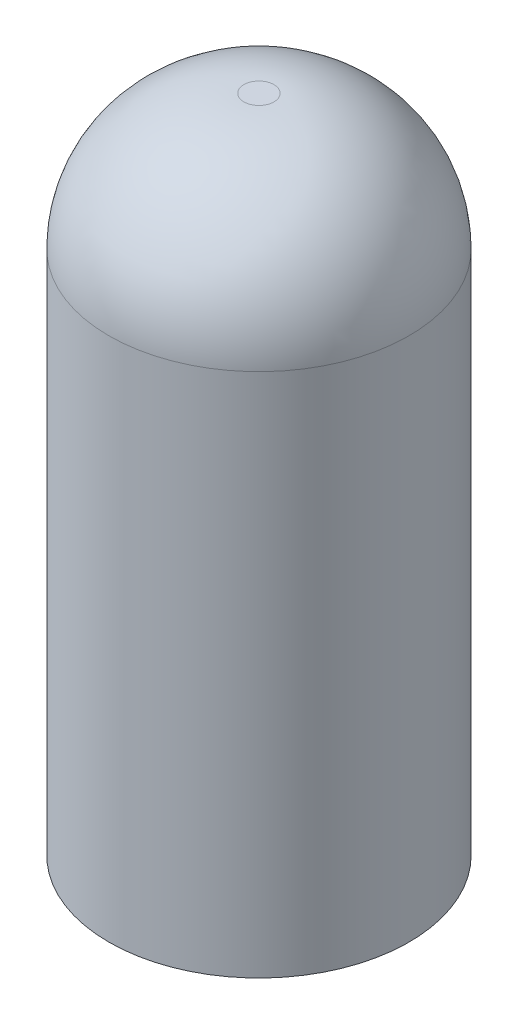
ISO-10303-21;
HEADER;
FILE_DESCRIPTION(('STEP AP214'),'2;1');
FILE_NAME('part.step','',(''),(''),'','','');
FILE_SCHEMA(('AUTOMOTIVE_DESIGN { 1 0 10303 214 1 1 1 1 }'));
ENDSEC;
DATA;
#1=APPLICATION_CONTEXT('core data for automotive mechanical design processes');
#2=APPLICATION_PROTOCOL_DEFINITION('international standard','automotive_design',2000,#1);
#3=PRODUCT_CONTEXT('',#1,'mechanical');
#4=PRODUCT('Part','Part','',(#3));
#5=PRODUCT_RELATED_PRODUCT_CATEGORY('part','',(#4));
#6=PRODUCT_DEFINITION_FORMATION('','',#4);
#7=PRODUCT_DEFINITION_CONTEXT('part definition',#1,'design');
#8=PRODUCT_DEFINITION('design','',#6,#7);
#9=PRODUCT_DEFINITION_SHAPE('','',#8);
#10=(LENGTH_UNIT() NAMED_UNIT(*) SI_UNIT(.MILLI.,.METRE.));
#11=(NAMED_UNIT(*) PLANE_ANGLE_UNIT() SI_UNIT($,.RADIAN.));
#12=(NAMED_UNIT(*) SI_UNIT($,.STERADIAN.) SOLID_ANGLE_UNIT());
#13=UNCERTAINTY_MEASURE_WITH_UNIT(LENGTH_MEASURE(1.E-05),#10,'distance_accuracy_value','');
#14=(GEOMETRIC_REPRESENTATION_CONTEXT(3) GLOBAL_UNCERTAINTY_ASSIGNED_CONTEXT((#13)) GLOBAL_UNIT_ASSIGNED_CONTEXT((#10,
#11,#12)) REPRESENTATION_CONTEXT('',''));
#15=CARTESIAN_POINT('',(0.,0.,0.));
#16=DIRECTION('',(0.,0.,1.));
#17=DIRECTION('',(1.,0.,0.));
#18=AXIS2_PLACEMENT_3D('',#15,#16,#17);
#19=CARTESIAN_POINT('',(0.,27.94,0.));
#20=DIRECTION('',(0.,-1.,0.));
#21=DIRECTION('',(0.,0.,-1.));
#22=AXIS2_PLACEMENT_3D('',#19,#20,#21);
#23=CYLINDRICAL_SURFACE('',#22,6.35);
#24=CARTESIAN_POINT('',(0.,22.225,0.));
#25=DIRECTION('',(0.,1.,0.));
#26=DIRECTION('',(0.,0.,1.));
#27=AXIS2_PLACEMENT_3D('',#24,#25,#26);
#28=CIRCLE('',#27,6.35);
#29=CARTESIAN_POINT('',(0.,22.225,6.35));
#30=VERTEX_POINT('',#29);
#31=EDGE_CURVE('E10',#30,#30,#28,.F.);
#32=ORIENTED_EDGE('',*,*,#31,.T.);
#33=EDGE_LOOP('',(#32));
#34=FACE_BOUND('',#33,.T.);
#35=CARTESIAN_POINT('',(0.,0.,0.));
#36=DIRECTION('',(0.,1.,0.));
#37=DIRECTION('',(0.,0.,1.));
#38=AXIS2_PLACEMENT_3D('',#35,#36,#37);
#39=CIRCLE('',#38,6.35);
#40=CARTESIAN_POINT('',(0.,0.,6.35));
#41=VERTEX_POINT('',#40);
#42=EDGE_CURVE('E50',#41,#41,#39,.T.);
#43=ORIENTED_EDGE('',*,*,#42,.T.);
#44=EDGE_LOOP('',(#43));
#45=FACE_BOUND('',#44,.T.);
#46=ADVANCED_FACE('F37',(#34,#45),#23,.T.);
#47=CARTESIAN_POINT('',(0.,27.94,0.));
#48=DIRECTION('',(0.,1.,0.));
#49=DIRECTION('',(0.,0.,1.));
#50=AXIS2_PLACEMENT_3D('',#47,#48,#49);
#51=PLANE('',#50);
#52=CARTESIAN_POINT('',(0.,27.94,0.));
#53=DIRECTION('',(0.,1.,0.));
#54=DIRECTION('',(0.,0.,1.));
#55=AXIS2_PLACEMENT_3D('',#52,#53,#54);
#56=CIRCLE('',#55,0.635);
#57=CARTESIAN_POINT('',(0.,27.94,0.635));
#58=VERTEX_POINT('',#57);
#59=EDGE_CURVE('E45',#58,#58,#56,.T.);
#60=ORIENTED_EDGE('',*,*,#59,.T.);
#61=EDGE_LOOP('',(#60));
#62=FACE_BOUND('',#61,.T.);
#63=ADVANCED_FACE('F77',(#62),#51,.T.);
#64=CARTESIAN_POINT('',(0.,0.,0.));
#65=DIRECTION('',(0.,1.,0.));
#66=DIRECTION('',(0.,0.,1.));
#67=AXIS2_PLACEMENT_3D('',#64,#65,#66);
#68=PLANE('',#67);
#69=CARTESIAN_POINT('',(0.,0.,0.));
#70=DIRECTION('',(0.,-1.,0.));
#71=DIRECTION('',(0.,0.,-1.));
#72=AXIS2_PLACEMENT_3D('',#69,#70,#71);
#73=CIRCLE('',#72,1.778);
#74=CARTESIAN_POINT('',(0.,0.,-1.778));
#75=VERTEX_POINT('',#74);
#76=EDGE_CURVE('E58',#75,#75,#73,.T.);
#77=ORIENTED_EDGE('',*,*,#76,.F.);
#78=EDGE_LOOP('',(#77));
#79=FACE_BOUND('',#78,.T.);
#80=ORIENTED_EDGE('',*,*,#42,.F.);
#81=EDGE_LOOP('',(#80));
#82=FACE_BOUND('',#81,.T.);
#83=ADVANCED_FACE('F74',(#79,#82),#68,.F.);
#84=CARTESIAN_POINT('',(0.,22.225,0.));
#85=DIRECTION('',(0.,1.,0.));
#86=DIRECTION('',(0.,0.,1.));
#87=AXIS2_PLACEMENT_3D('',#84,#85,#86);
#88=DEGENERATE_TOROIDAL_SURFACE('',#87,0.635,5.715,.T.);
#89=ORIENTED_EDGE('',*,*,#31,.F.);
#90=EDGE_LOOP('',(#89));
#91=FACE_BOUND('',#90,.T.);
#92=ORIENTED_EDGE('',*,*,#59,.F.);
#93=EDGE_LOOP('',(#92));
#94=FACE_BOUND('',#93,.T.);
#95=ADVANCED_FACE('F39',(#91,#94),#88,.T.);
#96=CARTESIAN_POINT('',(0.,8.255,0.));
#97=DIRECTION('',(0.,-1.,0.));
#98=DIRECTION('',(0.,0.,-1.));
#99=AXIS2_PLACEMENT_3D('',#96,#97,#98);
#100=CYLINDRICAL_SURFACE('',#99,1.778);
#101=CARTESIAN_POINT('',(0.,8.255,0.));
#102=DIRECTION('',(0.,-1.,0.));
#103=DIRECTION('',(0.,0.,-1.));
#104=AXIS2_PLACEMENT_3D('',#101,#102,#103);
#105=CIRCLE('',#104,1.778);
#106=CARTESIAN_POINT('',(0.,8.255,-1.778));
#107=VERTEX_POINT('',#106);
#108=EDGE_CURVE('E55',#107,#107,#105,.T.);
#109=ORIENTED_EDGE('',*,*,#108,.F.);
#110=EDGE_LOOP('',(#109));
#111=FACE_BOUND('',#110,.T.);
#112=ORIENTED_EDGE('',*,*,#76,.T.);
#113=EDGE_LOOP('',(#112));
#114=FACE_BOUND('',#113,.T.);
#115=ADVANCED_FACE('F68',(#111,#114),#100,.F.);
#116=CARTESIAN_POINT('',(0.,8.255,0.));
#117=DIRECTION('',(0.,-1.,0.));
#118=DIRECTION('',(0.,0.,-1.));
#119=AXIS2_PLACEMENT_3D('',#116,#117,#118);
#120=PLANE('',#119);
#121=ORIENTED_EDGE('',*,*,#108,.T.);
#122=EDGE_LOOP('',(#121));
#123=FACE_BOUND('',#122,.T.);
#124=ADVANCED_FACE('F66',(#123),#120,.T.);
#125=CLOSED_SHELL('',(#46,#63,#83,#95,#115,#124));
#126=MANIFOLD_SOLID_BREP('B2',#125);
#127=ADVANCED_BREP_SHAPE_REPRESENTATION('',(#18,#126),#14);
#128=SHAPE_DEFINITION_REPRESENTATION(#9,#127);
ENDSEC;
END-ISO-10303-21;
